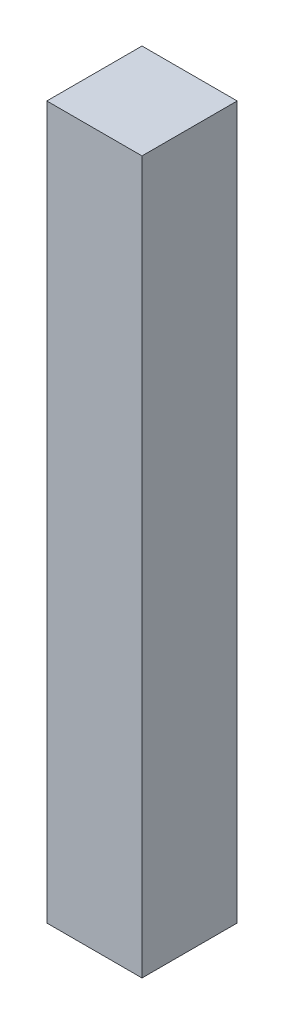
ISO-10303-21;
HEADER;
FILE_DESCRIPTION(('STEP AP214'),'2;1');
FILE_NAME('part.step','',(''),(''),'','','');
FILE_SCHEMA(('AUTOMOTIVE_DESIGN { 1 0 10303 214 1 1 1 1 }'));
ENDSEC;
DATA;
#1=APPLICATION_CONTEXT('core data for automotive mechanical design processes');
#2=APPLICATION_PROTOCOL_DEFINITION('international standard','automotive_design',2000,#1);
#3=PRODUCT_CONTEXT('',#1,'mechanical');
#4=PRODUCT('Part','Part','',(#3));
#5=PRODUCT_RELATED_PRODUCT_CATEGORY('part','',(#4));
#6=PRODUCT_DEFINITION_FORMATION('','',#4);
#7=PRODUCT_DEFINITION_CONTEXT('part definition',#1,'design');
#8=PRODUCT_DEFINITION('design','',#6,#7);
#9=PRODUCT_DEFINITION_SHAPE('','',#8);
#10=(LENGTH_UNIT() NAMED_UNIT(*) SI_UNIT(.MILLI.,.METRE.));
#11=(NAMED_UNIT(*) PLANE_ANGLE_UNIT() SI_UNIT($,.RADIAN.));
#12=(NAMED_UNIT(*) SI_UNIT($,.STERADIAN.) SOLID_ANGLE_UNIT());
#13=UNCERTAINTY_MEASURE_WITH_UNIT(LENGTH_MEASURE(1.E-05),#10,'distance_accuracy_value','');
#14=(GEOMETRIC_REPRESENTATION_CONTEXT(3) GLOBAL_UNCERTAINTY_ASSIGNED_CONTEXT((#13)) GLOBAL_UNIT_ASSIGNED_CONTEXT((#10,
#11,#12)) REPRESENTATION_CONTEXT('',''));
#15=CARTESIAN_POINT('',(0.,0.,0.));
#16=DIRECTION('',(0.,0.,1.));
#17=DIRECTION('',(1.,0.,0.));
#18=AXIS2_PLACEMENT_3D('',#15,#16,#17);
#19=CARTESIAN_POINT('',(12.7,190.,12.7));
#20=DIRECTION('',(-1.,0.,0.));
#21=DIRECTION('',(0.,0.,1.));
#22=AXIS2_PLACEMENT_3D('',#19,#20,#21);
#23=PLANE('',#22);
#24=DIRECTION('',(0.,0.,-1.));
#25=VECTOR('',#24,1.);
#26=CARTESIAN_POINT('',(12.7,0.,12.7));
#27=LINE('',#26,#25);
#28=CARTESIAN_POINT('',(12.7,0.,12.7));
#29=VERTEX_POINT('',#28);
#30=CARTESIAN_POINT('',(12.7,0.,-12.7));
#31=VERTEX_POINT('',#30);
#32=EDGE_CURVE('E99',#29,#31,#27,.T.);
#33=ORIENTED_EDGE('',*,*,#32,.T.);
#34=DIRECTION('',(0.,-1.,0.));
#35=VECTOR('',#34,1.);
#36=CARTESIAN_POINT('',(12.7,190.,-12.7));
#37=LINE('',#36,#35);
#38=CARTESIAN_POINT('',(12.7,190.,-12.7));
#39=VERTEX_POINT('',#38);
#40=EDGE_CURVE('E11',#39,#31,#37,.T.);
#41=ORIENTED_EDGE('',*,*,#40,.F.);
#42=DIRECTION('',(0.,0.,-1.));
#43=VECTOR('',#42,1.);
#44=CARTESIAN_POINT('',(12.7,190.,12.7));
#45=LINE('',#44,#43);
#46=CARTESIAN_POINT('',(12.7,190.,12.7));
#47=VERTEX_POINT('',#46);
#48=EDGE_CURVE('E87',#47,#39,#45,.T.);
#49=ORIENTED_EDGE('',*,*,#48,.F.);
#50=DIRECTION('',(0.,-1.,0.));
#51=VECTOR('',#50,1.);
#52=CARTESIAN_POINT('',(12.7,190.,12.7));
#53=LINE('',#52,#51);
#54=EDGE_CURVE('E95',#47,#29,#53,.T.);
#55=ORIENTED_EDGE('',*,*,#54,.T.);
#56=EDGE_LOOP('',(#33,#41,#49,#55));
#57=FACE_BOUND('',#56,.T.);
#58=ADVANCED_FACE('F36',(#57),#23,.F.);
#59=CARTESIAN_POINT('',(-12.7,190.,-12.7));
#60=DIRECTION('',(0.,0.,1.));
#61=DIRECTION('',(1.,0.,0.));
#62=AXIS2_PLACEMENT_3D('',#59,#60,#61);
#63=PLANE('',#62);
#64=DIRECTION('',(-1.,0.,0.));
#65=VECTOR('',#64,1.);
#66=CARTESIAN_POINT('',(-12.7,0.,-12.7));
#67=LINE('',#66,#65);
#68=CARTESIAN_POINT('',(-12.7,0.,-12.7));
#69=VERTEX_POINT('',#68);
#70=EDGE_CURVE('E91',#31,#69,#67,.T.);
#71=ORIENTED_EDGE('',*,*,#70,.T.);
#72=DIRECTION('',(0.,-1.,0.));
#73=VECTOR('',#72,1.);
#74=CARTESIAN_POINT('',(-12.7,190.,-12.7));
#75=LINE('',#74,#73);
#76=CARTESIAN_POINT('',(-12.7,190.,-12.7));
#77=VERTEX_POINT('',#76);
#78=EDGE_CURVE('E44',#77,#69,#75,.T.);
#79=ORIENTED_EDGE('',*,*,#78,.F.);
#80=DIRECTION('',(-1.,0.,0.));
#81=VECTOR('',#80,1.);
#82=CARTESIAN_POINT('',(-12.7,190.,-12.7));
#83=LINE('',#82,#81);
#84=EDGE_CURVE('E82',#39,#77,#83,.T.);
#85=ORIENTED_EDGE('',*,*,#84,.F.);
#86=ORIENTED_EDGE('',*,*,#40,.T.);
#87=EDGE_LOOP('',(#71,#79,#85,#86));
#88=FACE_BOUND('',#87,.T.);
#89=ADVANCED_FACE('F90',(#88),#63,.F.);
#90=CARTESIAN_POINT('',(-12.7,190.,12.7));
#91=DIRECTION('',(1.,0.,0.));
#92=DIRECTION('',(0.,0.,-1.));
#93=AXIS2_PLACEMENT_3D('',#90,#91,#92);
#94=PLANE('',#93);
#95=DIRECTION('',(0.,0.,1.));
#96=VECTOR('',#95,1.);
#97=CARTESIAN_POINT('',(-12.7,0.,12.7));
#98=LINE('',#97,#96);
#99=CARTESIAN_POINT('',(-12.7,0.,12.7));
#100=VERTEX_POINT('',#99);
#101=EDGE_CURVE('E69',#69,#100,#98,.T.);
#102=ORIENTED_EDGE('',*,*,#101,.T.);
#103=DIRECTION('',(0.,-1.,0.));
#104=VECTOR('',#103,1.);
#105=CARTESIAN_POINT('',(-12.7,190.,12.7));
#106=LINE('',#105,#104);
#107=CARTESIAN_POINT('',(-12.7,190.,12.7));
#108=VERTEX_POINT('',#107);
#109=EDGE_CURVE('E92',#108,#100,#106,.T.);
#110=ORIENTED_EDGE('',*,*,#109,.F.);
#111=DIRECTION('',(0.,0.,1.));
#112=VECTOR('',#111,1.);
#113=CARTESIAN_POINT('',(-12.7,190.,12.7));
#114=LINE('',#113,#112);
#115=EDGE_CURVE('E85',#77,#108,#114,.T.);
#116=ORIENTED_EDGE('',*,*,#115,.F.);
#117=ORIENTED_EDGE('',*,*,#78,.T.);
#118=EDGE_LOOP('',(#102,#110,#116,#117));
#119=FACE_BOUND('',#118,.T.);
#120=ADVANCED_FACE('F93',(#119),#94,.F.);
#121=CARTESIAN_POINT('',(-12.7,190.,12.7));
#122=DIRECTION('',(0.,0.,-1.));
#123=DIRECTION('',(-1.,0.,0.));
#124=AXIS2_PLACEMENT_3D('',#121,#122,#123);
#125=PLANE('',#124);
#126=DIRECTION('',(1.,0.,0.));
#127=VECTOR('',#126,1.);
#128=CARTESIAN_POINT('',(-12.7,0.,12.7));
#129=LINE('',#128,#127);
#130=EDGE_CURVE('E75',#100,#29,#129,.T.);
#131=ORIENTED_EDGE('',*,*,#130,.T.);
#132=ORIENTED_EDGE('',*,*,#54,.F.);
#133=DIRECTION('',(1.,0.,0.));
#134=VECTOR('',#133,1.);
#135=CARTESIAN_POINT('',(-12.7,190.,12.7));
#136=LINE('',#135,#134);
#137=EDGE_CURVE('E52',#108,#47,#136,.T.);
#138=ORIENTED_EDGE('',*,*,#137,.F.);
#139=ORIENTED_EDGE('',*,*,#109,.T.);
#140=EDGE_LOOP('',(#131,#132,#138,#139));
#141=FACE_BOUND('',#140,.T.);
#142=ADVANCED_FACE('F106',(#141),#125,.F.);
#143=CARTESIAN_POINT('',(0.,190.,0.));
#144=DIRECTION('',(0.,-1.,0.));
#145=DIRECTION('',(0.,0.,-1.));
#146=AXIS2_PLACEMENT_3D('',#143,#144,#145);
#147=PLANE('',#146);
#148=ORIENTED_EDGE('',*,*,#48,.T.);
#149=ORIENTED_EDGE('',*,*,#84,.T.);
#150=ORIENTED_EDGE('',*,*,#115,.T.);
#151=ORIENTED_EDGE('',*,*,#137,.T.);
#152=EDGE_LOOP('',(#148,#149,#150,#151));
#153=FACE_BOUND('',#152,.T.);
#154=ADVANCED_FACE('F83',(#153),#147,.F.);
#155=CARTESIAN_POINT('',(0.,0.,0.));
#156=DIRECTION('',(0.,-1.,0.));
#157=DIRECTION('',(0.,0.,-1.));
#158=AXIS2_PLACEMENT_3D('',#155,#156,#157);
#159=PLANE('',#158);
#160=ORIENTED_EDGE('',*,*,#32,.F.);
#161=ORIENTED_EDGE('',*,*,#130,.F.);
#162=ORIENTED_EDGE('',*,*,#101,.F.);
#163=ORIENTED_EDGE('',*,*,#70,.F.);
#164=EDGE_LOOP('',(#160,#161,#162,#163));
#165=FACE_BOUND('',#164,.T.);
#166=ADVANCED_FACE('F109',(#165),#159,.T.);
#167=CLOSED_SHELL('',(#58,#89,#120,#142,#154,#166));
#168=MANIFOLD_SOLID_BREP('B2',#167);
#169=ADVANCED_BREP_SHAPE_REPRESENTATION('',(#18,#168),#14);
#170=SHAPE_DEFINITION_REPRESENTATION(#9,#169);
ENDSEC;
END-ISO-10303-21;
